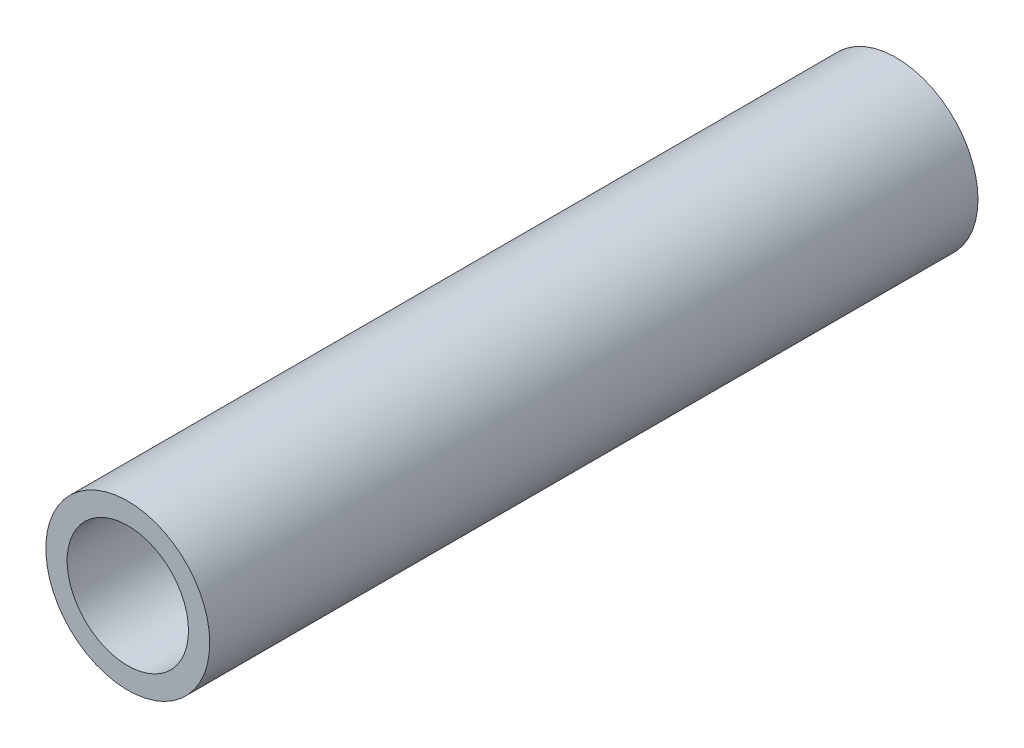
ISO-10303-21;
HEADER;
FILE_DESCRIPTION(('STEP AP214'),'2;1');
FILE_NAME('part.step','',(''),(''),'','','');
FILE_SCHEMA(('AUTOMOTIVE_DESIGN { 1 0 10303 214 1 1 1 1 }'));
ENDSEC;
DATA;
#1=APPLICATION_CONTEXT('core data for automotive mechanical design processes');
#2=APPLICATION_PROTOCOL_DEFINITION('international standard','automotive_design',2000,#1);
#3=PRODUCT_CONTEXT('',#1,'mechanical');
#4=PRODUCT('Part','Part','',(#3));
#5=PRODUCT_RELATED_PRODUCT_CATEGORY('part','',(#4));
#6=PRODUCT_DEFINITION_FORMATION('','',#4);
#7=PRODUCT_DEFINITION_CONTEXT('part definition',#1,'design');
#8=PRODUCT_DEFINITION('design','',#6,#7);
#9=PRODUCT_DEFINITION_SHAPE('','',#8);
#10=(LENGTH_UNIT() NAMED_UNIT(*) SI_UNIT(.MILLI.,.METRE.));
#11=(NAMED_UNIT(*) PLANE_ANGLE_UNIT() SI_UNIT($,.RADIAN.));
#12=(NAMED_UNIT(*) SI_UNIT($,.STERADIAN.) SOLID_ANGLE_UNIT());
#13=UNCERTAINTY_MEASURE_WITH_UNIT(LENGTH_MEASURE(1.E-05),#10,'distance_accuracy_value','');
#14=(GEOMETRIC_REPRESENTATION_CONTEXT(3) GLOBAL_UNCERTAINTY_ASSIGNED_CONTEXT((#13)) GLOBAL_UNIT_ASSIGNED_CONTEXT((#10,
#11,#12)) REPRESENTATION_CONTEXT('',''));
#15=CARTESIAN_POINT('',(0.,0.,0.));
#16=DIRECTION('',(0.,0.,1.));
#17=DIRECTION('',(1.,0.,0.));
#18=AXIS2_PLACEMENT_3D('',#15,#16,#17);
#19=CARTESIAN_POINT('',(0.,0.,50.));
#20=DIRECTION('',(0.,0.,1.));
#21=DIRECTION('',(1.,0.,0.));
#22=AXIS2_PLACEMENT_3D('',#19,#20,#21);
#23=PLANE('',#22);
#24=CARTESIAN_POINT('',(0.,0.,50.));
#25=DIRECTION('',(0.,0.,1.));
#26=DIRECTION('',(1.,0.,0.));
#27=AXIS2_PLACEMENT_3D('',#24,#25,#26);
#28=CIRCLE('',#27,10.668);
#29=CARTESIAN_POINT('',(10.668,0.,50.));
#30=VERTEX_POINT('',#29);
#31=EDGE_CURVE('E11',#30,#30,#28,.T.);
#32=ORIENTED_EDGE('',*,*,#31,.T.);
#33=EDGE_LOOP('',(#32));
#34=FACE_BOUND('',#33,.T.);
#35=CARTESIAN_POINT('',(0.,0.,50.));
#36=DIRECTION('',(0.,0.,1.));
#37=DIRECTION('',(1.,0.,0.));
#38=AXIS2_PLACEMENT_3D('',#35,#36,#37);
#39=CIRCLE('',#38,7.8994);
#40=CARTESIAN_POINT('',(7.8994,0.,50.));
#41=VERTEX_POINT('',#40);
#42=EDGE_CURVE('E50',#41,#41,#39,.T.);
#43=ORIENTED_EDGE('',*,*,#42,.F.);
#44=EDGE_LOOP('',(#43));
#45=FACE_BOUND('',#44,.T.);
#46=ADVANCED_FACE('F39',(#34,#45),#23,.T.);
#47=CARTESIAN_POINT('',(0.,0.,-50.));
#48=DIRECTION('',(0.,0.,1.));
#49=DIRECTION('',(1.,0.,0.));
#50=AXIS2_PLACEMENT_3D('',#47,#48,#49);
#51=PLANE('',#50);
#52=CARTESIAN_POINT('',(0.,0.,-50.));
#53=DIRECTION('',(0.,0.,1.));
#54=DIRECTION('',(1.,0.,0.));
#55=AXIS2_PLACEMENT_3D('',#52,#53,#54);
#56=CIRCLE('',#55,10.668);
#57=CARTESIAN_POINT('',(10.668,0.,-50.));
#58=VERTEX_POINT('',#57);
#59=EDGE_CURVE('E43',#58,#58,#56,.T.);
#60=ORIENTED_EDGE('',*,*,#59,.F.);
#61=EDGE_LOOP('',(#60));
#62=FACE_BOUND('',#61,.T.);
#63=CARTESIAN_POINT('',(0.,0.,-50.));
#64=DIRECTION('',(0.,0.,1.));
#65=DIRECTION('',(1.,0.,0.));
#66=AXIS2_PLACEMENT_3D('',#63,#64,#65);
#67=CIRCLE('',#66,7.8994);
#68=CARTESIAN_POINT('',(7.8994,0.,-50.));
#69=VERTEX_POINT('',#68);
#70=EDGE_CURVE('E52',#69,#69,#67,.T.);
#71=ORIENTED_EDGE('',*,*,#70,.T.);
#72=EDGE_LOOP('',(#71));
#73=FACE_BOUND('',#72,.T.);
#74=ADVANCED_FACE('F62',(#62,#73),#51,.F.);
#75=CARTESIAN_POINT('',(0.,0.,50.));
#76=DIRECTION('',(0.,0.,-1.));
#77=DIRECTION('',(-1.,0.,0.));
#78=AXIS2_PLACEMENT_3D('',#75,#76,#77);
#79=CYLINDRICAL_SURFACE('',#78,10.668);
#80=ORIENTED_EDGE('',*,*,#31,.F.);
#81=EDGE_LOOP('',(#80));
#82=FACE_BOUND('',#81,.T.);
#83=ORIENTED_EDGE('',*,*,#59,.T.);
#84=EDGE_LOOP('',(#83));
#85=FACE_BOUND('',#84,.T.);
#86=ADVANCED_FACE('F41',(#82,#85),#79,.T.);
#87=CARTESIAN_POINT('',(0.,0.,50.));
#88=DIRECTION('',(0.,0.,-1.));
#89=DIRECTION('',(-1.,0.,0.));
#90=AXIS2_PLACEMENT_3D('',#87,#88,#89);
#91=CYLINDRICAL_SURFACE('',#90,7.8994);
#92=ORIENTED_EDGE('',*,*,#42,.T.);
#93=EDGE_LOOP('',(#92));
#94=FACE_BOUND('',#93,.T.);
#95=ORIENTED_EDGE('',*,*,#70,.F.);
#96=EDGE_LOOP('',(#95));
#97=FACE_BOUND('',#96,.T.);
#98=ADVANCED_FACE('F58',(#94,#97),#91,.F.);
#99=CLOSED_SHELL('',(#46,#74,#86,#98));
#100=MANIFOLD_SOLID_BREP('B2',#99);
#101=ADVANCED_BREP_SHAPE_REPRESENTATION('',(#18,#100),#14);
#102=SHAPE_DEFINITION_REPRESENTATION(#9,#101);
ENDSEC;
END-ISO-10303-21;
